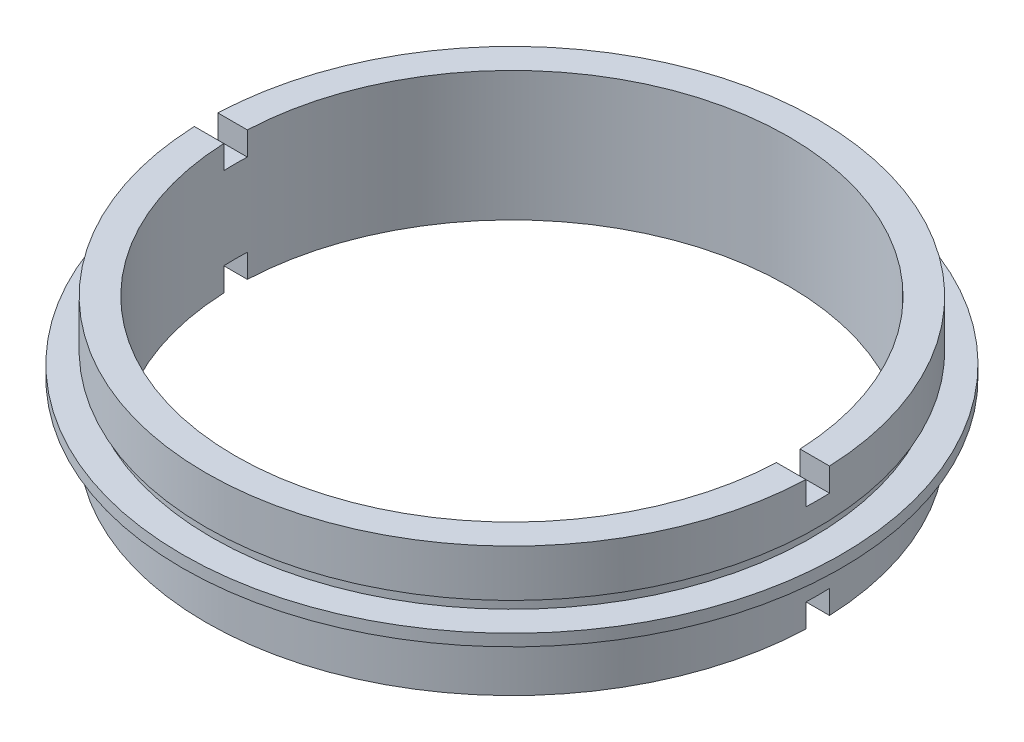
ISO-10303-21;
HEADER;
FILE_DESCRIPTION(('STEP AP214'),'2;1');
FILE_NAME('part.step','',(''),(''),'','','');
FILE_SCHEMA(('AUTOMOTIVE_DESIGN { 1 0 10303 214 1 1 1 1 }'));
ENDSEC;
DATA;
#1=APPLICATION_CONTEXT('core data for automotive mechanical design processes');
#2=APPLICATION_PROTOCOL_DEFINITION('international standard','automotive_design',2000,#1);
#3=PRODUCT_CONTEXT('',#1,'mechanical');
#4=PRODUCT('Part','Part','',(#3));
#5=PRODUCT_RELATED_PRODUCT_CATEGORY('part','',(#4));
#6=PRODUCT_DEFINITION_FORMATION('','',#4);
#7=PRODUCT_DEFINITION_CONTEXT('part definition',#1,'design');
#8=PRODUCT_DEFINITION('design','',#6,#7);
#9=PRODUCT_DEFINITION_SHAPE('','',#8);
#10=(LENGTH_UNIT() NAMED_UNIT(*) SI_UNIT(.MILLI.,.METRE.));
#11=(NAMED_UNIT(*) PLANE_ANGLE_UNIT() SI_UNIT($,.RADIAN.));
#12=(NAMED_UNIT(*) SI_UNIT($,.STERADIAN.) SOLID_ANGLE_UNIT());
#13=UNCERTAINTY_MEASURE_WITH_UNIT(LENGTH_MEASURE(1.E-05),#10,'distance_accuracy_value','');
#14=(GEOMETRIC_REPRESENTATION_CONTEXT(3) GLOBAL_UNCERTAINTY_ASSIGNED_CONTEXT((#13)) GLOBAL_UNIT_ASSIGNED_CONTEXT((#10,
#11,#12)) REPRESENTATION_CONTEXT('',''));
#15=CARTESIAN_POINT('',(0.,0.,0.));
#16=DIRECTION('',(0.,0.,1.));
#17=DIRECTION('',(1.,0.,0.));
#18=AXIS2_PLACEMENT_3D('',#15,#16,#17);
#19=CARTESIAN_POINT('',(-26.,0.,0.));
#20=DIRECTION('',(0.,-1.,0.));
#21=DIRECTION('',(0.,0.,-1.));
#22=AXIS2_PLACEMENT_3D('',#19,#20,#21);
#23=PLANE('',#22);
#24=DIRECTION('',(-1.,0.,0.));
#25=VECTOR('',#24,1.);
#26=CARTESIAN_POINT('',(-26.,0.,1.));
#27=LINE('',#26,#25);
#28=CARTESIAN_POINT('',(25.9807621135332,0.,1.));
#29=VERTEX_POINT('',#28);
#30=CARTESIAN_POINT('',(23.4787137637478,0.,1.));
#31=VERTEX_POINT('',#30);
#32=EDGE_CURVE('E264',#29,#31,#27,.T.);
#33=ORIENTED_EDGE('',*,*,#32,.F.);
#34=CARTESIAN_POINT('',(0.,0.,0.));
#35=DIRECTION('',(0.,1.,0.));
#36=DIRECTION('',(0.,0.,1.));
#37=AXIS2_PLACEMENT_3D('',#34,#35,#36);
#38=CIRCLE('',#37,26.);
#39=CARTESIAN_POINT('',(-25.9807621135332,0.,1.));
#40=VERTEX_POINT('',#39);
#41=EDGE_CURVE('E213',#40,#29,#38,.T.);
#42=ORIENTED_EDGE('',*,*,#41,.F.);
#43=CARTESIAN_POINT('',(-23.4787137637478,0.,1.));
#44=VERTEX_POINT('',#43);
#45=EDGE_CURVE('E263',#44,#40,#27,.T.);
#46=ORIENTED_EDGE('',*,*,#45,.F.);
#47=CARTESIAN_POINT('',(0.,0.,0.));
#48=DIRECTION('',(0.,1.,0.));
#49=DIRECTION('',(0.,0.,1.));
#50=AXIS2_PLACEMENT_3D('',#47,#48,#49);
#51=CIRCLE('',#50,23.5);
#52=EDGE_CURVE('E209',#44,#31,#51,.T.);
#53=ORIENTED_EDGE('',*,*,#52,.T.);
#54=EDGE_LOOP('',(#33,#42,#46,#53));
#55=FACE_BOUND('',#54,.T.);
#56=ADVANCED_FACE('F34',(#55),#23,.T.);
#57=CARTESIAN_POINT('',(-23.5,11.,0.));
#58=DIRECTION('',(0.,1.,0.));
#59=DIRECTION('',(0.,0.,1.));
#60=AXIS2_PLACEMENT_3D('',#57,#58,#59);
#61=PLANE('',#60);
#62=DIRECTION('',(1.,0.,0.));
#63=VECTOR('',#62,1.);
#64=CARTESIAN_POINT('',(-23.5,11.,1.));
#65=LINE('',#64,#63);
#66=CARTESIAN_POINT('',(-25.9807621135332,11.,1.));
#67=VERTEX_POINT('',#66);
#68=CARTESIAN_POINT('',(-23.4787137637478,11.,1.));
#69=VERTEX_POINT('',#68);
#70=EDGE_CURVE('E202',#67,#69,#65,.T.);
#71=ORIENTED_EDGE('',*,*,#70,.F.);
#72=CARTESIAN_POINT('',(0.,11.,0.));
#73=DIRECTION('',(0.,1.,0.));
#74=DIRECTION('',(0.,0.,1.));
#75=AXIS2_PLACEMENT_3D('',#72,#73,#74);
#76=CIRCLE('',#75,26.);
#77=CARTESIAN_POINT('',(25.9807621135332,11.,1.));
#78=VERTEX_POINT('',#77);
#79=EDGE_CURVE('E240',#67,#78,#76,.T.);
#80=ORIENTED_EDGE('',*,*,#79,.T.);
#81=CARTESIAN_POINT('',(23.4787137637478,11.,1.));
#82=VERTEX_POINT('',#81);
#83=EDGE_CURVE('E205',#82,#78,#65,.T.);
#84=ORIENTED_EDGE('',*,*,#83,.F.);
#85=CARTESIAN_POINT('',(0.,11.,0.));
#86=DIRECTION('',(0.,1.,0.));
#87=DIRECTION('',(0.,0.,1.));
#88=AXIS2_PLACEMENT_3D('',#85,#86,#87);
#89=CIRCLE('',#88,23.5);
#90=EDGE_CURVE('E244',#69,#82,#89,.T.);
#91=ORIENTED_EDGE('',*,*,#90,.F.);
#92=EDGE_LOOP('',(#71,#80,#84,#91));
#93=FACE_BOUND('',#92,.T.);
#94=ADVANCED_FACE('F302',(#93),#61,.T.);
#95=CARTESIAN_POINT('',(0.,22.6774994510759,0.));
#96=DIRECTION('',(0.,1.,0.));
#97=DIRECTION('',(0.,0.,1.));
#98=AXIS2_PLACEMENT_3D('',#95,#96,#97);
#99=CYLINDRICAL_SURFACE('',#98,23.5);
#100=DIRECTION('',(0.,1.,0.));
#101=VECTOR('',#100,1.);
#102=CARTESIAN_POINT('',(-23.4787137637478,22.6774994510759,1.));
#103=LINE('',#102,#101);
#104=CARTESIAN_POINT('',(-23.4787137637478,2.,1.));
#105=VERTEX_POINT('',#104);
#106=EDGE_CURVE('E176',#105,#44,#103,.F.);
#107=ORIENTED_EDGE('',*,*,#106,.F.);
#108=CARTESIAN_POINT('',(0.,2.,0.));
#109=DIRECTION('',(0.,1.,0.));
#110=DIRECTION('',(0.,0.,1.));
#111=AXIS2_PLACEMENT_3D('',#108,#109,#110);
#112=CIRCLE('',#111,23.5);
#113=CARTESIAN_POINT('',(-23.4787137637478,2.,-1.));
#114=VERTEX_POINT('',#113);
#115=EDGE_CURVE('E182',#114,#105,#112,.T.);
#116=ORIENTED_EDGE('',*,*,#115,.F.);
#117=DIRECTION('',(0.,1.,0.));
#118=VECTOR('',#117,1.);
#119=CARTESIAN_POINT('',(-23.4787137637478,22.6774994510759,-0.999999999999994));
#120=LINE('',#119,#118);
#121=CARTESIAN_POINT('',(-23.4787137637478,0.,-1.));
#122=VERTEX_POINT('',#121);
#123=EDGE_CURVE('E158',#122,#114,#120,.T.);
#124=ORIENTED_EDGE('',*,*,#123,.F.);
#125=CARTESIAN_POINT('',(23.4787137637478,0.,-1.));
#126=VERTEX_POINT('',#125);
#127=EDGE_CURVE('E212',#126,#122,#51,.T.);
#128=ORIENTED_EDGE('',*,*,#127,.F.);
#129=DIRECTION('',(0.,1.,0.));
#130=VECTOR('',#129,1.);
#131=CARTESIAN_POINT('',(23.4787137637478,22.6774994510759,-0.999999999999994));
#132=LINE('',#131,#130);
#133=CARTESIAN_POINT('',(23.4787137637478,2.,-1.));
#134=VERTEX_POINT('',#133);
#135=EDGE_CURVE('E57',#134,#126,#132,.F.);
#136=ORIENTED_EDGE('',*,*,#135,.F.);
#137=CARTESIAN_POINT('',(23.4787137637478,2.,1.));
#138=VERTEX_POINT('',#137);
#139=EDGE_CURVE('E184',#138,#134,#112,.T.);
#140=ORIENTED_EDGE('',*,*,#139,.F.);
#141=DIRECTION('',(0.,1.,0.));
#142=VECTOR('',#141,1.);
#143=CARTESIAN_POINT('',(23.4787137637478,22.6774994510759,1.));
#144=LINE('',#143,#142);
#145=EDGE_CURVE('E180',#31,#138,#144,.T.);
#146=ORIENTED_EDGE('',*,*,#145,.F.);
#147=ORIENTED_EDGE('',*,*,#52,.F.);
#148=EDGE_LOOP('',(#107,#116,#124,#128,#136,#140,#146,#147));
#149=FACE_BOUND('',#148,.T.);
#150=DIRECTION('',(0.,1.,0.));
#151=VECTOR('',#150,1.);
#152=CARTESIAN_POINT('',(23.4787137637478,22.6774994510759,1.));
#153=LINE('',#152,#151);
#154=CARTESIAN_POINT('',(23.4787137637478,9.,1.));
#155=VERTEX_POINT('',#154);
#156=EDGE_CURVE('E207',#155,#82,#153,.T.);
#157=ORIENTED_EDGE('',*,*,#156,.F.);
#158=CARTESIAN_POINT('',(0.,9.,0.));
#159=DIRECTION('',(0.,-1.,0.));
#160=DIRECTION('',(0.,0.,-1.));
#161=AXIS2_PLACEMENT_3D('',#158,#159,#160);
#162=CIRCLE('',#161,23.5);
#163=CARTESIAN_POINT('',(23.4787137637478,9.,-0.999999999999997));
#164=VERTEX_POINT('',#163);
#165=EDGE_CURVE('E194',#164,#155,#162,.T.);
#166=ORIENTED_EDGE('',*,*,#165,.F.);
#167=DIRECTION('',(0.,1.,0.));
#168=VECTOR('',#167,1.);
#169=CARTESIAN_POINT('',(23.4787137637478,22.6774994510759,-1.));
#170=LINE('',#169,#168);
#171=CARTESIAN_POINT('',(23.4787137637478,11.,-0.999999999999998));
#172=VERTEX_POINT('',#171);
#173=EDGE_CURVE('E197',#172,#164,#170,.F.);
#174=ORIENTED_EDGE('',*,*,#173,.F.);
#175=CARTESIAN_POINT('',(-23.4787137637478,11.,-0.999999999999998));
#176=VERTEX_POINT('',#175);
#177=EDGE_CURVE('E247',#172,#176,#89,.T.);
#178=ORIENTED_EDGE('',*,*,#177,.T.);
#179=DIRECTION('',(0.,1.,0.));
#180=VECTOR('',#179,1.);
#181=CARTESIAN_POINT('',(-23.4787137637478,22.6774994510759,-1.));
#182=LINE('',#181,#180);
#183=CARTESIAN_POINT('',(-23.4787137637478,9.,-0.999999999999997));
#184=VERTEX_POINT('',#183);
#185=EDGE_CURVE('E200',#184,#176,#182,.T.);
#186=ORIENTED_EDGE('',*,*,#185,.F.);
#187=CARTESIAN_POINT('',(-23.4787137637478,9.,1.));
#188=VERTEX_POINT('',#187);
#189=EDGE_CURVE('E192',#188,#184,#162,.T.);
#190=ORIENTED_EDGE('',*,*,#189,.F.);
#191=DIRECTION('',(0.,1.,0.));
#192=VECTOR('',#191,1.);
#193=CARTESIAN_POINT('',(-23.4787137637478,22.6774994510759,1.));
#194=LINE('',#193,#192);
#195=EDGE_CURVE('E204',#69,#188,#194,.F.);
#196=ORIENTED_EDGE('',*,*,#195,.F.);
#197=ORIENTED_EDGE('',*,*,#90,.T.);
#198=EDGE_LOOP('',(#157,#166,#174,#178,#186,#190,#196,#197));
#199=FACE_BOUND('',#198,.T.);
#200=ADVANCED_FACE('F36',(#149,#199),#99,.F.);
#201=DIRECTION('',(-1.,0.,0.));
#202=VECTOR('',#201,1.);
#203=CARTESIAN_POINT('',(-23.5,11.,-0.999999999999998));
#204=LINE('',#203,#202);
#205=CARTESIAN_POINT('',(25.9807621135332,11.,-1.));
#206=VERTEX_POINT('',#205);
#207=EDGE_CURVE('E195',#206,#172,#204,.T.);
#208=ORIENTED_EDGE('',*,*,#207,.F.);
#209=CARTESIAN_POINT('',(-25.9807621135332,11.,-1.));
#210=VERTEX_POINT('',#209);
#211=EDGE_CURVE('E243',#206,#210,#76,.T.);
#212=ORIENTED_EDGE('',*,*,#211,.T.);
#213=EDGE_CURVE('E198',#176,#210,#204,.T.);
#214=ORIENTED_EDGE('',*,*,#213,.F.);
#215=ORIENTED_EDGE('',*,*,#177,.F.);
#216=EDGE_LOOP('',(#208,#212,#214,#215));
#217=FACE_BOUND('',#216,.T.);
#218=ADVANCED_FACE('F308',(#217),#61,.T.);
#219=CARTESIAN_POINT('',(0.,22.6774994510759,0.));
#220=DIRECTION('',(0.,1.,0.));
#221=DIRECTION('',(0.,0.,1.));
#222=AXIS2_PLACEMENT_3D('',#219,#220,#221);
#223=CYLINDRICAL_SURFACE('',#222,26.);
#224=DIRECTION('',(0.,1.,0.));
#225=VECTOR('',#224,1.);
#226=CARTESIAN_POINT('',(-25.9807621135332,22.6774994510759,1.));
#227=LINE('',#226,#225);
#228=CARTESIAN_POINT('',(-25.9807621135332,9.,1.));
#229=VERTEX_POINT('',#228);
#230=EDGE_CURVE('E259',#229,#67,#227,.T.);
#231=ORIENTED_EDGE('',*,*,#230,.F.);
#232=CARTESIAN_POINT('',(0.,9.,0.));
#233=DIRECTION('',(0.,-1.,0.));
#234=DIRECTION('',(0.,0.,-1.));
#235=AXIS2_PLACEMENT_3D('',#232,#233,#234);
#236=CIRCLE('',#235,26.);
#237=CARTESIAN_POINT('',(-25.9807621135332,9.,-0.999999999999997));
#238=VERTEX_POINT('',#237);
#239=EDGE_CURVE('E251',#238,#229,#236,.F.);
#240=ORIENTED_EDGE('',*,*,#239,.F.);
#241=DIRECTION('',(0.,1.,0.));
#242=VECTOR('',#241,1.);
#243=CARTESIAN_POINT('',(-25.9807621135332,22.6774994510759,-1.));
#244=LINE('',#243,#242);
#245=EDGE_CURVE('E256',#210,#238,#244,.F.);
#246=ORIENTED_EDGE('',*,*,#245,.F.);
#247=ORIENTED_EDGE('',*,*,#211,.F.);
#248=DIRECTION('',(0.,1.,0.));
#249=VECTOR('',#248,1.);
#250=CARTESIAN_POINT('',(25.9807621135332,22.6774994510759,-1.));
#251=LINE('',#250,#249);
#252=CARTESIAN_POINT('',(25.9807621135332,9.,-0.999999999999997));
#253=VERTEX_POINT('',#252);
#254=EDGE_CURVE('E250',#253,#206,#251,.T.);
#255=ORIENTED_EDGE('',*,*,#254,.F.);
#256=CARTESIAN_POINT('',(25.9807621135332,9.,1.));
#257=VERTEX_POINT('',#256);
#258=EDGE_CURVE('E248',#257,#253,#236,.F.);
#259=ORIENTED_EDGE('',*,*,#258,.F.);
#260=DIRECTION('',(0.,1.,0.));
#261=VECTOR('',#260,1.);
#262=CARTESIAN_POINT('',(25.9807621135332,22.6774994510759,1.));
#263=LINE('',#262,#261);
#264=EDGE_CURVE('E253',#78,#257,#263,.F.);
#265=ORIENTED_EDGE('',*,*,#264,.F.);
#266=ORIENTED_EDGE('',*,*,#79,.F.);
#267=EDGE_LOOP('',(#231,#240,#246,#247,#255,#259,#265,#266));
#268=FACE_BOUND('',#267,.T.);
#269=CARTESIAN_POINT('',(0.,7.,0.));
#270=DIRECTION('',(0.,1.,0.));
#271=DIRECTION('',(0.,0.,1.));
#272=AXIS2_PLACEMENT_3D('',#269,#270,#271);
#273=CIRCLE('',#272,26.);
#274=CARTESIAN_POINT('',(0.,7.,26.));
#275=VERTEX_POINT('',#274);
#276=EDGE_CURVE('E237',#275,#275,#273,.T.);
#277=ORIENTED_EDGE('',*,*,#276,.T.);
#278=EDGE_LOOP('',(#277));
#279=FACE_BOUND('',#278,.T.);
#280=ADVANCED_FACE('F351',(#268,#279),#223,.T.);
#281=CARTESIAN_POINT('',(-26.,7.,0.));
#282=DIRECTION('',(0.,-1.,0.));
#283=DIRECTION('',(0.,0.,-1.));
#284=AXIS2_PLACEMENT_3D('',#281,#282,#283);
#285=PLANE('',#284);
#286=CARTESIAN_POINT('',(0.,7.,0.));
#287=DIRECTION('',(0.,1.,0.));
#288=DIRECTION('',(0.,0.,1.));
#289=AXIS2_PLACEMENT_3D('',#286,#287,#288);
#290=CIRCLE('',#289,25.5);
#291=CARTESIAN_POINT('',(0.,7.,25.5));
#292=VERTEX_POINT('',#291);
#293=EDGE_CURVE('E234',#292,#292,#290,.T.);
#294=ORIENTED_EDGE('',*,*,#293,.T.);
#295=EDGE_LOOP('',(#294));
#296=FACE_BOUND('',#295,.T.);
#297=ORIENTED_EDGE('',*,*,#276,.F.);
#298=EDGE_LOOP('',(#297));
#299=FACE_BOUND('',#298,.T.);
#300=ADVANCED_FACE('F347',(#296,#299),#285,.T.);
#301=CARTESIAN_POINT('',(0.,22.6774994510759,0.));
#302=DIRECTION('',(0.,1.,0.));
#303=DIRECTION('',(0.,0.,1.));
#304=AXIS2_PLACEMENT_3D('',#301,#302,#303);
#305=CYLINDRICAL_SURFACE('',#304,25.5);
#306=CARTESIAN_POINT('',(0.,6.,0.));
#307=DIRECTION('',(0.,1.,0.));
#308=DIRECTION('',(0.,0.,1.));
#309=AXIS2_PLACEMENT_3D('',#306,#307,#308);
#310=CIRCLE('',#309,25.5);
#311=CARTESIAN_POINT('',(0.,6.,25.5));
#312=VERTEX_POINT('',#311);
#313=EDGE_CURVE('E231',#312,#312,#310,.T.);
#314=ORIENTED_EDGE('',*,*,#313,.T.);
#315=EDGE_LOOP('',(#314));
#316=FACE_BOUND('',#315,.T.);
#317=ORIENTED_EDGE('',*,*,#293,.F.);
#318=EDGE_LOOP('',(#317));
#319=FACE_BOUND('',#318,.T.);
#320=ADVANCED_FACE('F343',(#316,#319),#305,.T.);
#321=CARTESIAN_POINT('',(-25.5,6.,0.));
#322=DIRECTION('',(0.,1.,0.));
#323=DIRECTION('',(0.,0.,1.));
#324=AXIS2_PLACEMENT_3D('',#321,#322,#323);
#325=PLANE('',#324);
#326=CARTESIAN_POINT('',(0.,6.,0.));
#327=DIRECTION('',(0.,1.,0.));
#328=DIRECTION('',(0.,0.,1.));
#329=AXIS2_PLACEMENT_3D('',#326,#327,#328);
#330=CIRCLE('',#329,28.);
#331=CARTESIAN_POINT('',(0.,6.,28.));
#332=VERTEX_POINT('',#331);
#333=EDGE_CURVE('E228',#332,#332,#330,.T.);
#334=ORIENTED_EDGE('',*,*,#333,.T.);
#335=EDGE_LOOP('',(#334));
#336=FACE_BOUND('',#335,.T.);
#337=ORIENTED_EDGE('',*,*,#313,.F.);
#338=EDGE_LOOP('',(#337));
#339=FACE_BOUND('',#338,.T.);
#340=ADVANCED_FACE('F339',(#336,#339),#325,.T.);
#341=CARTESIAN_POINT('',(0.,22.6774994510759,0.));
#342=DIRECTION('',(0.,1.,0.));
#343=DIRECTION('',(0.,0.,1.));
#344=AXIS2_PLACEMENT_3D('',#341,#342,#343);
#345=CYLINDRICAL_SURFACE('',#344,28.);
#346=CARTESIAN_POINT('',(0.,5.,0.));
#347=DIRECTION('',(0.,1.,0.));
#348=DIRECTION('',(0.,0.,1.));
#349=AXIS2_PLACEMENT_3D('',#346,#347,#348);
#350=CIRCLE('',#349,28.);
#351=CARTESIAN_POINT('',(0.,5.,28.));
#352=VERTEX_POINT('',#351);
#353=EDGE_CURVE('E225',#352,#352,#350,.T.);
#354=ORIENTED_EDGE('',*,*,#353,.T.);
#355=EDGE_LOOP('',(#354));
#356=FACE_BOUND('',#355,.T.);
#357=ORIENTED_EDGE('',*,*,#333,.F.);
#358=EDGE_LOOP('',(#357));
#359=FACE_BOUND('',#358,.T.);
#360=ADVANCED_FACE('F335',(#356,#359),#345,.T.);
#361=CARTESIAN_POINT('',(-28.,5.,0.));
#362=DIRECTION('',(0.,-1.,0.));
#363=DIRECTION('',(0.,0.,-1.));
#364=AXIS2_PLACEMENT_3D('',#361,#362,#363);
#365=PLANE('',#364);
#366=CARTESIAN_POINT('',(0.,5.,0.));
#367=DIRECTION('',(0.,1.,0.));
#368=DIRECTION('',(0.,0.,1.));
#369=AXIS2_PLACEMENT_3D('',#366,#367,#368);
#370=CIRCLE('',#369,25.5);
#371=CARTESIAN_POINT('',(0.,5.,25.5));
#372=VERTEX_POINT('',#371);
#373=EDGE_CURVE('E222',#372,#372,#370,.T.);
#374=ORIENTED_EDGE('',*,*,#373,.T.);
#375=EDGE_LOOP('',(#374));
#376=FACE_BOUND('',#375,.T.);
#377=ORIENTED_EDGE('',*,*,#353,.F.);
#378=EDGE_LOOP('',(#377));
#379=FACE_BOUND('',#378,.T.);
#380=ADVANCED_FACE('F331',(#376,#379),#365,.T.);
#381=CARTESIAN_POINT('',(0.,22.6774994510759,0.));
#382=DIRECTION('',(0.,1.,0.));
#383=DIRECTION('',(0.,0.,1.));
#384=AXIS2_PLACEMENT_3D('',#381,#382,#383);
#385=CYLINDRICAL_SURFACE('',#384,25.5);
#386=CARTESIAN_POINT('',(0.,4.,0.));
#387=DIRECTION('',(0.,1.,0.));
#388=DIRECTION('',(0.,0.,1.));
#389=AXIS2_PLACEMENT_3D('',#386,#387,#388);
#390=CIRCLE('',#389,25.5);
#391=CARTESIAN_POINT('',(0.,4.,25.5));
#392=VERTEX_POINT('',#391);
#393=EDGE_CURVE('E219',#392,#392,#390,.T.);
#394=ORIENTED_EDGE('',*,*,#393,.T.);
#395=EDGE_LOOP('',(#394));
#396=FACE_BOUND('',#395,.T.);
#397=ORIENTED_EDGE('',*,*,#373,.F.);
#398=EDGE_LOOP('',(#397));
#399=FACE_BOUND('',#398,.T.);
#400=ADVANCED_FACE('F325',(#396,#399),#385,.T.);
#401=CARTESIAN_POINT('',(-25.5,4.,0.));
#402=DIRECTION('',(0.,1.,0.));
#403=DIRECTION('',(0.,0.,1.));
#404=AXIS2_PLACEMENT_3D('',#401,#402,#403);
#405=PLANE('',#404);
#406=CARTESIAN_POINT('',(0.,4.,0.));
#407=DIRECTION('',(0.,1.,0.));
#408=DIRECTION('',(0.,0.,1.));
#409=AXIS2_PLACEMENT_3D('',#406,#407,#408);
#410=CIRCLE('',#409,26.);
#411=CARTESIAN_POINT('',(0.,4.,26.));
#412=VERTEX_POINT('',#411);
#413=EDGE_CURVE('E216',#412,#412,#410,.T.);
#414=ORIENTED_EDGE('',*,*,#413,.T.);
#415=EDGE_LOOP('',(#414));
#416=FACE_BOUND('',#415,.T.);
#417=ORIENTED_EDGE('',*,*,#393,.F.);
#418=EDGE_LOOP('',(#417));
#419=FACE_BOUND('',#418,.T.);
#420=ADVANCED_FACE('F321',(#416,#419),#405,.T.);
#421=CARTESIAN_POINT('',(0.,22.6774994510759,0.));
#422=DIRECTION('',(0.,1.,0.));
#423=DIRECTION('',(0.,0.,1.));
#424=AXIS2_PLACEMENT_3D('',#421,#422,#423);
#425=CYLINDRICAL_SURFACE('',#424,26.);
#426=DIRECTION('',(0.,1.,0.));
#427=VECTOR('',#426,1.);
#428=CARTESIAN_POINT('',(-25.9807621135332,22.6774994510759,1.));
#429=LINE('',#428,#427);
#430=CARTESIAN_POINT('',(-25.9807621135332,2.,1.));
#431=VERTEX_POINT('',#430);
#432=EDGE_CURVE('E169',#40,#431,#429,.T.);
#433=ORIENTED_EDGE('',*,*,#432,.F.);
#434=ORIENTED_EDGE('',*,*,#41,.T.);
#435=DIRECTION('',(0.,1.,0.));
#436=VECTOR('',#435,1.);
#437=CARTESIAN_POINT('',(25.9807621135332,22.6774994510759,1.));
#438=LINE('',#437,#436);
#439=CARTESIAN_POINT('',(25.9807621135332,2.,1.));
#440=VERTEX_POINT('',#439);
#441=EDGE_CURVE('E178',#440,#29,#438,.F.);
#442=ORIENTED_EDGE('',*,*,#441,.F.);
#443=CARTESIAN_POINT('',(0.,2.,0.));
#444=DIRECTION('',(0.,1.,0.));
#445=DIRECTION('',(0.,0.,1.));
#446=AXIS2_PLACEMENT_3D('',#443,#444,#445);
#447=CIRCLE('',#446,26.);
#448=CARTESIAN_POINT('',(25.9807621135332,2.,-1.));
#449=VERTEX_POINT('',#448);
#450=EDGE_CURVE('E38',#449,#440,#447,.F.);
#451=ORIENTED_EDGE('',*,*,#450,.F.);
#452=DIRECTION('',(0.,1.,0.));
#453=VECTOR('',#452,1.);
#454=CARTESIAN_POINT('',(25.9807621135332,22.6774994510759,-0.999999999999994));
#455=LINE('',#454,#453);
#456=CARTESIAN_POINT('',(25.9807621135332,0.,-1.));
#457=VERTEX_POINT('',#456);
#458=EDGE_CURVE('E171',#457,#449,#455,.T.);
#459=ORIENTED_EDGE('',*,*,#458,.F.);
#460=CARTESIAN_POINT('',(-25.9807621135332,0.,-1.));
#461=VERTEX_POINT('',#460);
#462=EDGE_CURVE('E167',#457,#461,#38,.T.);
#463=ORIENTED_EDGE('',*,*,#462,.T.);
#464=DIRECTION('',(0.,1.,0.));
#465=VECTOR('',#464,1.);
#466=CARTESIAN_POINT('',(-25.9807621135332,22.6774994510759,-0.999999999999994));
#467=LINE('',#466,#465);
#468=CARTESIAN_POINT('',(-25.9807621135332,2.,-1.));
#469=VERTEX_POINT('',#468);
#470=EDGE_CURVE('E49',#469,#461,#467,.F.);
#471=ORIENTED_EDGE('',*,*,#470,.F.);
#472=EDGE_CURVE('E11',#431,#469,#447,.F.);
#473=ORIENTED_EDGE('',*,*,#472,.F.);
#474=EDGE_LOOP('',(#433,#434,#442,#451,#459,#463,#471,#473));
#475=FACE_BOUND('',#474,.T.);
#476=ORIENTED_EDGE('',*,*,#413,.F.);
#477=EDGE_LOOP('',(#476));
#478=FACE_BOUND('',#477,.T.);
#479=ADVANCED_FACE('F163',(#475,#478),#425,.T.);
#480=DIRECTION('',(1.,0.,0.));
#481=VECTOR('',#480,1.);
#482=CARTESIAN_POINT('',(-26.,0.,-1.));
#483=LINE('',#482,#481);
#484=EDGE_CURVE('E262',#461,#122,#483,.T.);
#485=ORIENTED_EDGE('',*,*,#484,.F.);
#486=ORIENTED_EDGE('',*,*,#462,.F.);
#487=EDGE_CURVE('E261',#126,#457,#483,.T.);
#488=ORIENTED_EDGE('',*,*,#487,.F.);
#489=ORIENTED_EDGE('',*,*,#127,.T.);
#490=EDGE_LOOP('',(#485,#486,#488,#489));
#491=FACE_BOUND('',#490,.T.);
#492=ADVANCED_FACE('F273',(#491),#23,.T.);
#493=CARTESIAN_POINT('',(-39.5,9.,1.));
#494=DIRECTION('',(0.,-1.,0.));
#495=DIRECTION('',(0.,0.,-1.));
#496=AXIS2_PLACEMENT_3D('',#493,#494,#495);
#497=PLANE('',#496);
#498=ORIENTED_EDGE('',*,*,#165,.T.);
#499=DIRECTION('',(1.,0.,0.));
#500=VECTOR('',#499,1.);
#501=CARTESIAN_POINT('',(-39.5,9.,1.));
#502=LINE('',#501,#500);
#503=EDGE_CURVE('E190',#155,#257,#502,.T.);
#504=ORIENTED_EDGE('',*,*,#503,.T.);
#505=ORIENTED_EDGE('',*,*,#258,.T.);
#506=DIRECTION('',(1.,0.,0.));
#507=VECTOR('',#506,1.);
#508=CARTESIAN_POINT('',(-39.5,9.,-0.999999999999997));
#509=LINE('',#508,#507);
#510=EDGE_CURVE('E185',#164,#253,#509,.T.);
#511=ORIENTED_EDGE('',*,*,#510,.F.);
#512=EDGE_LOOP('',(#498,#504,#505,#511));
#513=FACE_BOUND('',#512,.T.);
#514=ADVANCED_FACE('F312',(#513),#497,.F.);
#515=CARTESIAN_POINT('',(-39.5,13.5939878717808,-0.999999999999998));
#516=DIRECTION('',(0.,0.,-1.));
#517=DIRECTION('',(0.,1.,0.));
#518=AXIS2_PLACEMENT_3D('',#515,#516,#517);
#519=PLANE('',#518);
#520=ORIENTED_EDGE('',*,*,#173,.T.);
#521=ORIENTED_EDGE('',*,*,#510,.T.);
#522=ORIENTED_EDGE('',*,*,#254,.T.);
#523=ORIENTED_EDGE('',*,*,#207,.T.);
#524=EDGE_LOOP('',(#520,#521,#522,#523));
#525=FACE_BOUND('',#524,.T.);
#526=ADVANCED_FACE('F317',(#525),#519,.F.);
#527=CARTESIAN_POINT('',(-39.5,13.5939878717808,1.));
#528=DIRECTION('',(0.,0.,1.));
#529=DIRECTION('',(0.,-1.,0.));
#530=AXIS2_PLACEMENT_3D('',#527,#528,#529);
#531=PLANE('',#530);
#532=ORIENTED_EDGE('',*,*,#156,.T.);
#533=ORIENTED_EDGE('',*,*,#83,.T.);
#534=ORIENTED_EDGE('',*,*,#264,.T.);
#535=ORIENTED_EDGE('',*,*,#503,.F.);
#536=EDGE_LOOP('',(#532,#533,#534,#535));
#537=FACE_BOUND('',#536,.T.);
#538=ADVANCED_FACE('F400',(#537),#531,.F.);
#539=ORIENTED_EDGE('',*,*,#185,.T.);
#540=ORIENTED_EDGE('',*,*,#213,.T.);
#541=ORIENTED_EDGE('',*,*,#245,.T.);
#542=EDGE_CURVE('E188',#238,#184,#509,.T.);
#543=ORIENTED_EDGE('',*,*,#542,.T.);
#544=EDGE_LOOP('',(#539,#540,#541,#543));
#545=FACE_BOUND('',#544,.T.);
#546=ADVANCED_FACE('F376',(#545),#519,.F.);
#547=ORIENTED_EDGE('',*,*,#195,.T.);
#548=EDGE_CURVE('E189',#229,#188,#502,.T.);
#549=ORIENTED_EDGE('',*,*,#548,.F.);
#550=ORIENTED_EDGE('',*,*,#230,.T.);
#551=ORIENTED_EDGE('',*,*,#70,.T.);
#552=EDGE_LOOP('',(#547,#549,#550,#551));
#553=FACE_BOUND('',#552,.T.);
#554=ADVANCED_FACE('F391',(#553),#531,.F.);
#555=ORIENTED_EDGE('',*,*,#189,.T.);
#556=ORIENTED_EDGE('',*,*,#542,.F.);
#557=ORIENTED_EDGE('',*,*,#239,.T.);
#558=ORIENTED_EDGE('',*,*,#548,.T.);
#559=EDGE_LOOP('',(#555,#556,#557,#558));
#560=FACE_BOUND('',#559,.T.);
#561=ADVANCED_FACE('F320',(#560),#497,.F.);
#562=CARTESIAN_POINT('',(-39.5,2.,-1.));
#563=DIRECTION('',(0.,0.,-1.));
#564=DIRECTION('',(0.,1.,0.));
#565=AXIS2_PLACEMENT_3D('',#562,#563,#564);
#566=PLANE('',#565);
#567=ORIENTED_EDGE('',*,*,#135,.T.);
#568=ORIENTED_EDGE('',*,*,#487,.T.);
#569=ORIENTED_EDGE('',*,*,#458,.T.);
#570=DIRECTION('',(1.,0.,0.));
#571=VECTOR('',#570,1.);
#572=CARTESIAN_POINT('',(-39.5,2.,-1.));
#573=LINE('',#572,#571);
#574=EDGE_CURVE('E160',#134,#449,#573,.T.);
#575=ORIENTED_EDGE('',*,*,#574,.F.);
#576=EDGE_LOOP('',(#567,#568,#569,#575));
#577=FACE_BOUND('',#576,.T.);
#578=ADVANCED_FACE('F274',(#577),#566,.F.);
#579=CARTESIAN_POINT('',(-39.5,2.,1.));
#580=DIRECTION('',(0.,0.,1.));
#581=DIRECTION('',(0.,-1.,0.));
#582=AXIS2_PLACEMENT_3D('',#579,#580,#581);
#583=PLANE('',#582);
#584=ORIENTED_EDGE('',*,*,#145,.T.);
#585=DIRECTION('',(1.,0.,0.));
#586=VECTOR('',#585,1.);
#587=CARTESIAN_POINT('',(-39.5,2.,1.));
#588=LINE('',#587,#586);
#589=EDGE_CURVE('E159',#138,#440,#588,.T.);
#590=ORIENTED_EDGE('',*,*,#589,.T.);
#591=ORIENTED_EDGE('',*,*,#441,.T.);
#592=ORIENTED_EDGE('',*,*,#32,.T.);
#593=EDGE_LOOP('',(#584,#590,#591,#592));
#594=FACE_BOUND('',#593,.T.);
#595=ADVANCED_FACE('F282',(#594),#583,.F.);
#596=CARTESIAN_POINT('',(-39.5,2.,1.));
#597=DIRECTION('',(0.,1.,0.));
#598=DIRECTION('',(0.,0.,1.));
#599=AXIS2_PLACEMENT_3D('',#596,#597,#598);
#600=PLANE('',#599);
#601=ORIENTED_EDGE('',*,*,#139,.T.);
#602=ORIENTED_EDGE('',*,*,#574,.T.);
#603=ORIENTED_EDGE('',*,*,#450,.T.);
#604=ORIENTED_EDGE('',*,*,#589,.F.);
#605=EDGE_LOOP('',(#601,#602,#603,#604));
#606=FACE_BOUND('',#605,.T.);
#607=ADVANCED_FACE('F290',(#606),#600,.F.);
#608=ORIENTED_EDGE('',*,*,#123,.T.);
#609=EDGE_CURVE('E150',#469,#114,#573,.T.);
#610=ORIENTED_EDGE('',*,*,#609,.F.);
#611=ORIENTED_EDGE('',*,*,#470,.T.);
#612=ORIENTED_EDGE('',*,*,#484,.T.);
#613=EDGE_LOOP('',(#608,#610,#611,#612));
#614=FACE_BOUND('',#613,.T.);
#615=ADVANCED_FACE('F156',(#614),#566,.F.);
#616=ORIENTED_EDGE('',*,*,#106,.T.);
#617=ORIENTED_EDGE('',*,*,#45,.T.);
#618=ORIENTED_EDGE('',*,*,#432,.T.);
#619=EDGE_CURVE('E153',#431,#105,#588,.T.);
#620=ORIENTED_EDGE('',*,*,#619,.T.);
#621=EDGE_LOOP('',(#616,#617,#618,#620));
#622=FACE_BOUND('',#621,.T.);
#623=ADVANCED_FACE('F297',(#622),#583,.F.);
#624=ORIENTED_EDGE('',*,*,#115,.T.);
#625=ORIENTED_EDGE('',*,*,#619,.F.);
#626=ORIENTED_EDGE('',*,*,#472,.T.);
#627=ORIENTED_EDGE('',*,*,#609,.T.);
#628=EDGE_LOOP('',(#624,#625,#626,#627));
#629=FACE_BOUND('',#628,.T.);
#630=ADVANCED_FACE('F149',(#629),#600,.F.);
#631=CLOSED_SHELL('',(#56,#94,#200,#218,#280,#300,#320,#340,#360,#380,#400,#420,#479,#492,#514,
#526,#538,#546,#554,#561,#578,#595,#607,#615,#623,#630));
#632=MANIFOLD_SOLID_BREP('B2',#631);
#633=ADVANCED_BREP_SHAPE_REPRESENTATION('',(#18,#632),#14);
#634=SHAPE_DEFINITION_REPRESENTATION(#9,#633);
ENDSEC;
END-ISO-10303-21;
